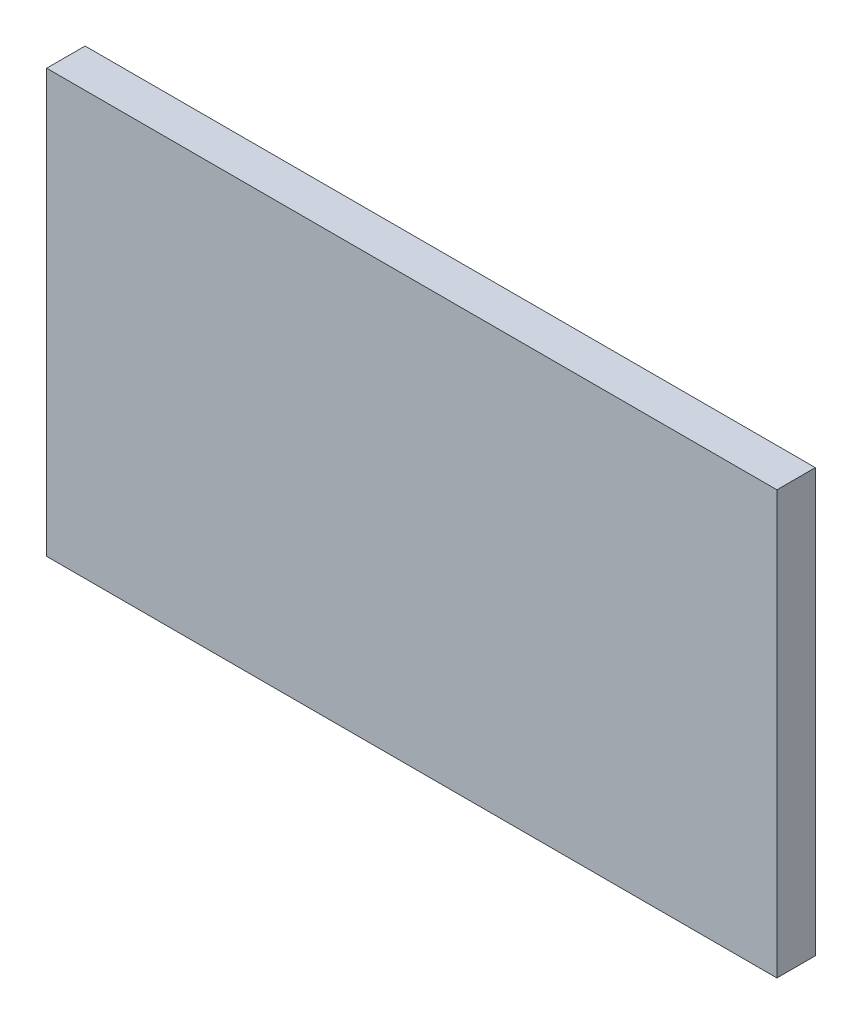
ISO-10303-21;
HEADER;
FILE_DESCRIPTION(('STEP AP214'),'2;1');
FILE_NAME('part.step','',(''),(''),'','','');
FILE_SCHEMA(('AUTOMOTIVE_DESIGN { 1 0 10303 214 1 1 1 1 }'));
ENDSEC;
DATA;
#1=APPLICATION_CONTEXT('core data for automotive mechanical design processes');
#2=APPLICATION_PROTOCOL_DEFINITION('international standard','automotive_design',2000,#1);
#3=PRODUCT_CONTEXT('',#1,'mechanical');
#4=PRODUCT('Part','Part','',(#3));
#5=PRODUCT_RELATED_PRODUCT_CATEGORY('part','',(#4));
#6=PRODUCT_DEFINITION_FORMATION('','',#4);
#7=PRODUCT_DEFINITION_CONTEXT('part definition',#1,'design');
#8=PRODUCT_DEFINITION('design','',#6,#7);
#9=PRODUCT_DEFINITION_SHAPE('','',#8);
#10=(LENGTH_UNIT() NAMED_UNIT(*) SI_UNIT(.MILLI.,.METRE.));
#11=(NAMED_UNIT(*) PLANE_ANGLE_UNIT() SI_UNIT($,.RADIAN.));
#12=(NAMED_UNIT(*) SI_UNIT($,.STERADIAN.) SOLID_ANGLE_UNIT());
#13=UNCERTAINTY_MEASURE_WITH_UNIT(LENGTH_MEASURE(1.E-05),#10,'distance_accuracy_value','');
#14=(GEOMETRIC_REPRESENTATION_CONTEXT(3) GLOBAL_UNCERTAINTY_ASSIGNED_CONTEXT((#13)) GLOBAL_UNIT_ASSIGNED_CONTEXT((#10,
#11,#12)) REPRESENTATION_CONTEXT('',''));
#15=CARTESIAN_POINT('',(0.,0.,0.));
#16=DIRECTION('',(0.,0.,1.));
#17=DIRECTION('',(1.,0.,0.));
#18=AXIS2_PLACEMENT_3D('',#15,#16,#17);
#19=CARTESIAN_POINT('',(-0.95,-0.55,0.1));
#20=DIRECTION('',(0.,0.,-1.));
#21=DIRECTION('',(-1.,0.,0.));
#22=AXIS2_PLACEMENT_3D('',#19,#20,#21);
#23=PLANE('',#22);
#24=DIRECTION('',(0.,1.,0.));
#25=VECTOR('',#24,1.);
#26=CARTESIAN_POINT('',(0.95,-0.55,0.1));
#27=LINE('',#26,#25);
#28=CARTESIAN_POINT('',(0.95,-0.55,0.1));
#29=VERTEX_POINT('',#28);
#30=CARTESIAN_POINT('',(0.95,0.55,0.1));
#31=VERTEX_POINT('',#30);
#32=EDGE_CURVE('E55',#29,#31,#27,.T.);
#33=ORIENTED_EDGE('',*,*,#32,.T.);
#34=DIRECTION('',(1.,0.,0.));
#35=VECTOR('',#34,1.);
#36=CARTESIAN_POINT('',(0.95,0.55,0.1));
#37=LINE('',#36,#35);
#38=CARTESIAN_POINT('',(-0.95,0.55,0.1));
#39=VERTEX_POINT('',#38);
#40=EDGE_CURVE('E57',#31,#39,#37,.F.);
#41=ORIENTED_EDGE('',*,*,#40,.T.);
#42=DIRECTION('',(0.,1.,0.));
#43=VECTOR('',#42,1.);
#44=CARTESIAN_POINT('',(-0.95,0.55,0.1));
#45=LINE('',#44,#43);
#46=CARTESIAN_POINT('',(-0.95,-0.55,0.1));
#47=VERTEX_POINT('',#46);
#48=EDGE_CURVE('E20',#39,#47,#45,.F.);
#49=ORIENTED_EDGE('',*,*,#48,.T.);
#50=DIRECTION('',(1.,0.,0.));
#51=VECTOR('',#50,1.);
#52=CARTESIAN_POINT('',(-0.95,-0.55,0.1));
#53=LINE('',#52,#51);
#54=EDGE_CURVE('E80',#47,#29,#53,.T.);
#55=ORIENTED_EDGE('',*,*,#54,.T.);
#56=EDGE_LOOP('',(#33,#41,#49,#55));
#57=FACE_BOUND('',#56,.T.);
#58=ADVANCED_FACE('F17',(#57),#23,.F.);
#59=CARTESIAN_POINT('',(-0.95,0.55,0.));
#60=DIRECTION('',(1.,0.,0.));
#61=DIRECTION('',(0.,0.,-1.));
#62=AXIS2_PLACEMENT_3D('',#59,#60,#61);
#63=PLANE('',#62);
#64=DIRECTION('',(0.,0.,1.));
#65=VECTOR('',#64,1.);
#66=CARTESIAN_POINT('',(-0.95,-0.55,0.));
#67=LINE('',#66,#65);
#68=CARTESIAN_POINT('',(-0.95,-0.55,0.));
#69=VERTEX_POINT('',#68);
#70=EDGE_CURVE('E68',#69,#47,#67,.T.);
#71=ORIENTED_EDGE('',*,*,#70,.T.);
#72=ORIENTED_EDGE('',*,*,#48,.F.);
#73=DIRECTION('',(0.,0.,-1.));
#74=VECTOR('',#73,1.);
#75=CARTESIAN_POINT('',(-0.95,0.55,0.));
#76=LINE('',#75,#74);
#77=CARTESIAN_POINT('',(-0.95,0.55,0.));
#78=VERTEX_POINT('',#77);
#79=EDGE_CURVE('E63',#39,#78,#76,.T.);
#80=ORIENTED_EDGE('',*,*,#79,.T.);
#81=DIRECTION('',(0.,1.,0.));
#82=VECTOR('',#81,1.);
#83=CARTESIAN_POINT('',(-0.95,-0.55,0.));
#84=LINE('',#83,#82);
#85=EDGE_CURVE('E83',#69,#78,#84,.T.);
#86=ORIENTED_EDGE('',*,*,#85,.F.);
#87=EDGE_LOOP('',(#71,#72,#80,#86));
#88=FACE_BOUND('',#87,.T.);
#89=ADVANCED_FACE('F65',(#88),#63,.F.);
#90=CARTESIAN_POINT('',(0.95,0.55,0.));
#91=DIRECTION('',(0.,-1.,0.));
#92=DIRECTION('',(0.,0.,-1.));
#93=AXIS2_PLACEMENT_3D('',#90,#91,#92);
#94=PLANE('',#93);
#95=ORIENTED_EDGE('',*,*,#79,.F.);
#96=ORIENTED_EDGE('',*,*,#40,.F.);
#97=DIRECTION('',(0.,0.,1.));
#98=VECTOR('',#97,1.);
#99=CARTESIAN_POINT('',(0.95,0.55,0.));
#100=LINE('',#99,#98);
#101=CARTESIAN_POINT('',(0.95,0.55,0.));
#102=VERTEX_POINT('',#101);
#103=EDGE_CURVE('E75',#31,#102,#100,.F.);
#104=ORIENTED_EDGE('',*,*,#103,.T.);
#105=DIRECTION('',(-1.,0.,0.));
#106=VECTOR('',#105,1.);
#107=CARTESIAN_POINT('',(-0.95,0.55,0.));
#108=LINE('',#107,#106);
#109=EDGE_CURVE('E72',#78,#102,#108,.F.);
#110=ORIENTED_EDGE('',*,*,#109,.F.);
#111=EDGE_LOOP('',(#95,#96,#104,#110));
#112=FACE_BOUND('',#111,.T.);
#113=ADVANCED_FACE('F70',(#112),#94,.F.);
#114=CARTESIAN_POINT('',(0.95,-0.55,0.));
#115=DIRECTION('',(-1.,0.,0.));
#116=DIRECTION('',(0.,0.,1.));
#117=AXIS2_PLACEMENT_3D('',#114,#115,#116);
#118=PLANE('',#117);
#119=ORIENTED_EDGE('',*,*,#103,.F.);
#120=ORIENTED_EDGE('',*,*,#32,.F.);
#121=DIRECTION('',(0.,0.,1.));
#122=VECTOR('',#121,1.);
#123=CARTESIAN_POINT('',(0.95,-0.55,0.));
#124=LINE('',#123,#122);
#125=CARTESIAN_POINT('',(0.95,-0.55,0.));
#126=VERTEX_POINT('',#125);
#127=EDGE_CURVE('E35',#29,#126,#124,.F.);
#128=ORIENTED_EDGE('',*,*,#127,.T.);
#129=DIRECTION('',(0.,1.,0.));
#130=VECTOR('',#129,1.);
#131=CARTESIAN_POINT('',(0.95,-0.55,0.));
#132=LINE('',#131,#130);
#133=EDGE_CURVE('E26',#102,#126,#132,.F.);
#134=ORIENTED_EDGE('',*,*,#133,.F.);
#135=EDGE_LOOP('',(#119,#120,#128,#134));
#136=FACE_BOUND('',#135,.T.);
#137=ADVANCED_FACE('F89',(#136),#118,.F.);
#138=CARTESIAN_POINT('',(-0.95,-0.55,0.));
#139=DIRECTION('',(0.,1.,0.));
#140=DIRECTION('',(0.,0.,1.));
#141=AXIS2_PLACEMENT_3D('',#138,#139,#140);
#142=PLANE('',#141);
#143=ORIENTED_EDGE('',*,*,#127,.F.);
#144=ORIENTED_EDGE('',*,*,#54,.F.);
#145=ORIENTED_EDGE('',*,*,#70,.F.);
#146=DIRECTION('',(-1.,0.,0.));
#147=VECTOR('',#146,1.);
#148=CARTESIAN_POINT('',(-0.95,-0.55,0.));
#149=LINE('',#148,#147);
#150=EDGE_CURVE('E11',#126,#69,#149,.T.);
#151=ORIENTED_EDGE('',*,*,#150,.F.);
#152=EDGE_LOOP('',(#143,#144,#145,#151));
#153=FACE_BOUND('',#152,.T.);
#154=ADVANCED_FACE('F91',(#153),#142,.F.);
#155=CARTESIAN_POINT('',(-0.95,-0.55,0.));
#156=DIRECTION('',(0.,0.,-1.));
#157=DIRECTION('',(-1.,0.,0.));
#158=AXIS2_PLACEMENT_3D('',#155,#156,#157);
#159=PLANE('',#158);
#160=ORIENTED_EDGE('',*,*,#133,.T.);
#161=ORIENTED_EDGE('',*,*,#150,.T.);
#162=ORIENTED_EDGE('',*,*,#85,.T.);
#163=ORIENTED_EDGE('',*,*,#109,.T.);
#164=EDGE_LOOP('',(#160,#161,#162,#163));
#165=FACE_BOUND('',#164,.T.);
#166=ADVANCED_FACE('F88',(#165),#159,.T.);
#167=CLOSED_SHELL('',(#58,#89,#113,#137,#154,#166));
#168=MANIFOLD_SOLID_BREP('B1',#167);
#169=ADVANCED_BREP_SHAPE_REPRESENTATION('',(#18,#168),#14);
#170=SHAPE_DEFINITION_REPRESENTATION(#9,#169);
ENDSEC;
END-ISO-10303-21;
